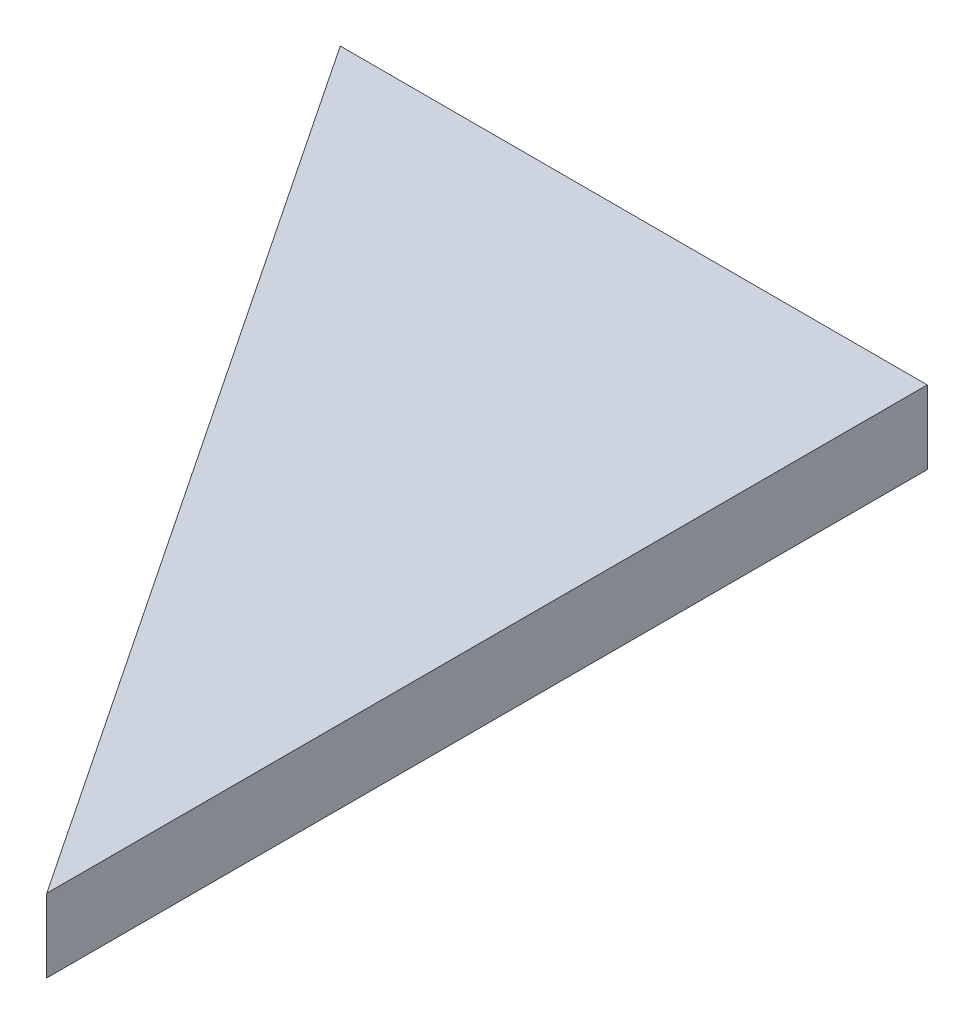
ISO-10303-21;
HEADER;
FILE_DESCRIPTION(('STEP AP214'),'2;1');
FILE_NAME('part.step','',(''),(''),'','','');
FILE_SCHEMA(('AUTOMOTIVE_DESIGN { 1 0 10303 214 1 1 1 1 }'));
ENDSEC;
DATA;
#1=APPLICATION_CONTEXT('core data for automotive mechanical design processes');
#2=APPLICATION_PROTOCOL_DEFINITION('international standard','automotive_design',2000,#1);
#3=PRODUCT_CONTEXT('',#1,'mechanical');
#4=PRODUCT('Part','Part','',(#3));
#5=PRODUCT_RELATED_PRODUCT_CATEGORY('part','',(#4));
#6=PRODUCT_DEFINITION_FORMATION('','',#4);
#7=PRODUCT_DEFINITION_CONTEXT('part definition',#1,'design');
#8=PRODUCT_DEFINITION('design','',#6,#7);
#9=PRODUCT_DEFINITION_SHAPE('','',#8);
#10=(LENGTH_UNIT() NAMED_UNIT(*) SI_UNIT(.MILLI.,.METRE.));
#11=(NAMED_UNIT(*) PLANE_ANGLE_UNIT() SI_UNIT($,.RADIAN.));
#12=(NAMED_UNIT(*) SI_UNIT($,.STERADIAN.) SOLID_ANGLE_UNIT());
#13=UNCERTAINTY_MEASURE_WITH_UNIT(LENGTH_MEASURE(1.E-05),#10,'distance_accuracy_value','');
#14=(GEOMETRIC_REPRESENTATION_CONTEXT(3) GLOBAL_UNCERTAINTY_ASSIGNED_CONTEXT((#13)) GLOBAL_UNIT_ASSIGNED_CONTEXT((#10,
#11,#12)) REPRESENTATION_CONTEXT('',''));
#15=CARTESIAN_POINT('',(0.,0.,0.));
#16=DIRECTION('',(0.,0.,1.));
#17=DIRECTION('',(1.,0.,0.));
#18=AXIS2_PLACEMENT_3D('',#15,#16,#17);
#19=CARTESIAN_POINT('',(101.6,12.7,152.4));
#20=DIRECTION('',(0.832050294337844,0.,-0.554700196225229));
#21=DIRECTION('',(-0.554700196225229,0.,-0.832050294337844));
#22=AXIS2_PLACEMENT_3D('',#19,#20,#21);
#23=PLANE('',#22);
#24=DIRECTION('',(0.554700196225229,0.,0.832050294337844));
#25=VECTOR('',#24,1.);
#26=CARTESIAN_POINT('',(101.6,0.,152.4));
#27=LINE('',#26,#25);
#28=CARTESIAN_POINT('',(0.,0.,0.));
#29=VERTEX_POINT('',#28);
#30=CARTESIAN_POINT('',(101.6,0.,152.4));
#31=VERTEX_POINT('',#30);
#32=EDGE_CURVE('E82',#29,#31,#27,.T.);
#33=ORIENTED_EDGE('',*,*,#32,.T.);
#34=DIRECTION('',(0.,-1.,0.));
#35=VECTOR('',#34,1.);
#36=CARTESIAN_POINT('',(101.6,12.7,152.4));
#37=LINE('',#36,#35);
#38=CARTESIAN_POINT('',(101.6,12.7,152.4));
#39=VERTEX_POINT('',#38);
#40=EDGE_CURVE('E11',#39,#31,#37,.T.);
#41=ORIENTED_EDGE('',*,*,#40,.F.);
#42=DIRECTION('',(0.554700196225229,0.,0.832050294337844));
#43=VECTOR('',#42,1.);
#44=CARTESIAN_POINT('',(101.6,12.7,152.4));
#45=LINE('',#44,#43);
#46=CARTESIAN_POINT('',(0.,12.7,0.));
#47=VERTEX_POINT('',#46);
#48=EDGE_CURVE('E75',#47,#39,#45,.T.);
#49=ORIENTED_EDGE('',*,*,#48,.F.);
#50=DIRECTION('',(0.,-1.,0.));
#51=VECTOR('',#50,1.);
#52=CARTESIAN_POINT('',(0.,12.7,0.));
#53=LINE('',#52,#51);
#54=EDGE_CURVE('E83',#47,#29,#53,.T.);
#55=ORIENTED_EDGE('',*,*,#54,.T.);
#56=EDGE_LOOP('',(#33,#41,#49,#55));
#57=FACE_BOUND('',#56,.T.);
#58=ADVANCED_FACE('F35',(#57),#23,.F.);
#59=CARTESIAN_POINT('',(101.6,12.7,0.));
#60=DIRECTION('',(-1.,0.,0.));
#61=DIRECTION('',(0.,0.,1.));
#62=AXIS2_PLACEMENT_3D('',#59,#60,#61);
#63=PLANE('',#62);
#64=DIRECTION('',(0.,0.,-1.));
#65=VECTOR('',#64,1.);
#66=CARTESIAN_POINT('',(101.6,0.,0.));
#67=LINE('',#66,#65);
#68=CARTESIAN_POINT('',(101.6,0.,0.));
#69=VERTEX_POINT('',#68);
#70=EDGE_CURVE('E63',#31,#69,#67,.T.);
#71=ORIENTED_EDGE('',*,*,#70,.T.);
#72=DIRECTION('',(0.,-1.,0.));
#73=VECTOR('',#72,1.);
#74=CARTESIAN_POINT('',(101.6,12.7,0.));
#75=LINE('',#74,#73);
#76=CARTESIAN_POINT('',(101.6,12.7,0.));
#77=VERTEX_POINT('',#76);
#78=EDGE_CURVE('E43',#77,#69,#75,.T.);
#79=ORIENTED_EDGE('',*,*,#78,.F.);
#80=DIRECTION('',(0.,0.,-1.));
#81=VECTOR('',#80,1.);
#82=CARTESIAN_POINT('',(101.6,12.7,0.));
#83=LINE('',#82,#81);
#84=EDGE_CURVE('E71',#39,#77,#83,.T.);
#85=ORIENTED_EDGE('',*,*,#84,.F.);
#86=ORIENTED_EDGE('',*,*,#40,.T.);
#87=EDGE_LOOP('',(#71,#79,#85,#86));
#88=FACE_BOUND('',#87,.T.);
#89=ADVANCED_FACE('F72',(#88),#63,.F.);
#90=CARTESIAN_POINT('',(0.,12.7,0.));
#91=DIRECTION('',(0.,0.,1.));
#92=DIRECTION('',(1.,0.,0.));
#93=AXIS2_PLACEMENT_3D('',#90,#91,#92);
#94=PLANE('',#93);
#95=DIRECTION('',(-1.,0.,0.));
#96=VECTOR('',#95,1.);
#97=CARTESIAN_POINT('',(0.,0.,0.));
#98=LINE('',#97,#96);
#99=EDGE_CURVE('E68',#69,#29,#98,.T.);
#100=ORIENTED_EDGE('',*,*,#99,.T.);
#101=ORIENTED_EDGE('',*,*,#54,.F.);
#102=DIRECTION('',(-1.,0.,0.));
#103=VECTOR('',#102,1.);
#104=CARTESIAN_POINT('',(0.,12.7,0.));
#105=LINE('',#104,#103);
#106=EDGE_CURVE('E51',#77,#47,#105,.T.);
#107=ORIENTED_EDGE('',*,*,#106,.F.);
#108=ORIENTED_EDGE('',*,*,#78,.T.);
#109=EDGE_LOOP('',(#100,#101,#107,#108));
#110=FACE_BOUND('',#109,.T.);
#111=ADVANCED_FACE('F90',(#110),#94,.F.);
#112=CARTESIAN_POINT('',(0.,12.7,0.));
#113=DIRECTION('',(0.,-1.,0.));
#114=DIRECTION('',(0.,0.,-1.));
#115=AXIS2_PLACEMENT_3D('',#112,#113,#114);
#116=PLANE('',#115);
#117=ORIENTED_EDGE('',*,*,#48,.T.);
#118=ORIENTED_EDGE('',*,*,#84,.T.);
#119=ORIENTED_EDGE('',*,*,#106,.T.);
#120=EDGE_LOOP('',(#117,#118,#119));
#121=FACE_BOUND('',#120,.T.);
#122=ADVANCED_FACE('F78',(#121),#116,.F.);
#123=CARTESIAN_POINT('',(0.,0.,0.));
#124=DIRECTION('',(0.,-1.,0.));
#125=DIRECTION('',(0.,0.,-1.));
#126=AXIS2_PLACEMENT_3D('',#123,#124,#125);
#127=PLANE('',#126);
#128=ORIENTED_EDGE('',*,*,#32,.F.);
#129=ORIENTED_EDGE('',*,*,#99,.F.);
#130=ORIENTED_EDGE('',*,*,#70,.F.);
#131=EDGE_LOOP('',(#128,#129,#130));
#132=FACE_BOUND('',#131,.T.);
#133=ADVANCED_FACE('F91',(#132),#127,.T.);
#134=CLOSED_SHELL('',(#58,#89,#111,#122,#133));
#135=MANIFOLD_SOLID_BREP('B2',#134);
#136=ADVANCED_BREP_SHAPE_REPRESENTATION('',(#18,#135),#14);
#137=SHAPE_DEFINITION_REPRESENTATION(#9,#136);
ENDSEC;
END-ISO-10303-21;
